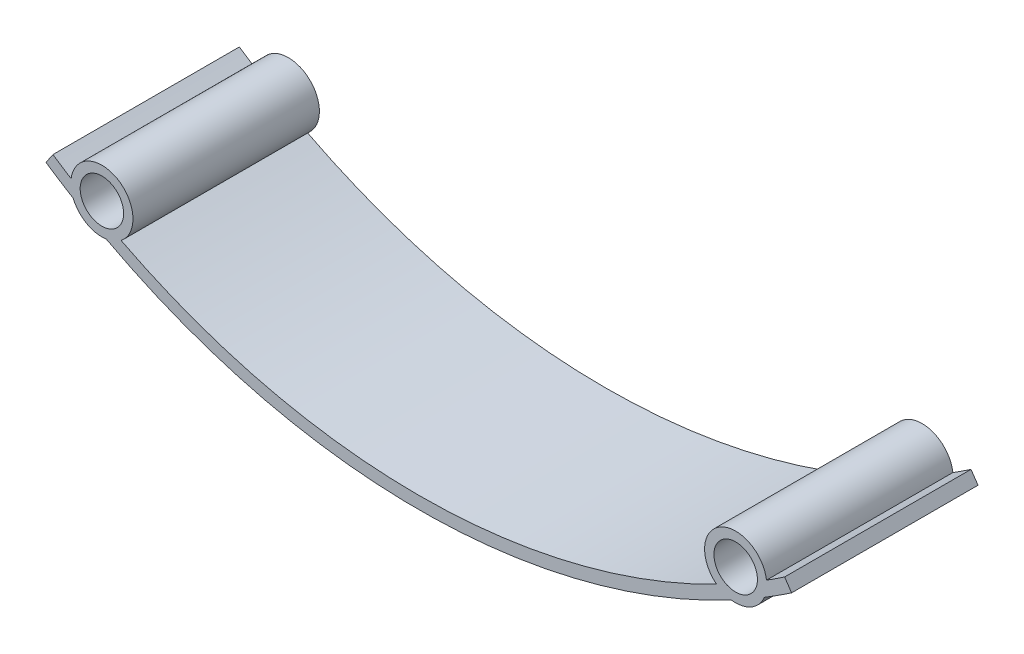
ISO-10303-21;
HEADER;
FILE_DESCRIPTION(('STEP AP214'),'2;1');
FILE_NAME('part.step','',(''),(''),'','','');
FILE_SCHEMA(('AUTOMOTIVE_DESIGN { 1 0 10303 214 1 1 1 1 }'));
ENDSEC;
DATA;
#1=APPLICATION_CONTEXT('core data for automotive mechanical design processes');
#2=APPLICATION_PROTOCOL_DEFINITION('international standard','automotive_design',2000,#1);
#3=PRODUCT_CONTEXT('',#1,'mechanical');
#4=PRODUCT('Part','Part','',(#3));
#5=PRODUCT_RELATED_PRODUCT_CATEGORY('part','',(#4));
#6=PRODUCT_DEFINITION_FORMATION('','',#4);
#7=PRODUCT_DEFINITION_CONTEXT('part definition',#1,'design');
#8=PRODUCT_DEFINITION('design','',#6,#7);
#9=PRODUCT_DEFINITION_SHAPE('','',#8);
#10=(LENGTH_UNIT() NAMED_UNIT(*) SI_UNIT(.MILLI.,.METRE.));
#11=(NAMED_UNIT(*) PLANE_ANGLE_UNIT() SI_UNIT($,.RADIAN.));
#12=(NAMED_UNIT(*) SI_UNIT($,.STERADIAN.) SOLID_ANGLE_UNIT());
#13=UNCERTAINTY_MEASURE_WITH_UNIT(LENGTH_MEASURE(1.E-05),#10,'distance_accuracy_value','');
#14=(GEOMETRIC_REPRESENTATION_CONTEXT(3) GLOBAL_UNCERTAINTY_ASSIGNED_CONTEXT((#13)) GLOBAL_UNIT_ASSIGNED_CONTEXT((#10,
#11,#12)) REPRESENTATION_CONTEXT('',''));
#15=CARTESIAN_POINT('',(0.,0.,0.));
#16=DIRECTION('',(0.,0.,1.));
#17=DIRECTION('',(1.,0.,0.));
#18=AXIS2_PLACEMENT_3D('',#15,#16,#17);
#19=CARTESIAN_POINT('',(0.,107.,30.));
#20=DIRECTION('',(0.,0.,-1.));
#21=DIRECTION('',(-1.,0.,0.));
#22=AXIS2_PLACEMENT_3D('',#19,#20,#21);
#23=PLANE('',#22);
#24=CARTESIAN_POINT('',(0.,107.,30.));
#25=DIRECTION('',(0.,0.,1.));
#26=DIRECTION('',(-1.,0.,0.));
#27=AXIS2_PLACEMENT_3D('',#24,#25,#26);
#28=CIRCLE('',#27,107.);
#29=CARTESIAN_POINT('',(55.615236982089,15.589139510526,30.));
#30=VERTEX_POINT('',#29);
#31=CARTESIAN_POINT('',(60.,18.4054177728683,30.));
#32=VERTEX_POINT('',#31);
#33=EDGE_CURVE('E181',#30,#32,#28,.T.);
#34=ORIENTED_EDGE('',*,*,#33,.T.);
#35=DIRECTION('',(-0.560747663551397,0.827986749786281,0.));
#36=VECTOR('',#35,1.);
#37=CARTESIAN_POINT('',(58.8785046728972,20.0613912724409,30.));
#38=LINE('',#37,#36);
#39=CARTESIAN_POINT('',(58.8785046728972,20.0613912724409,30.));
#40=VERTEX_POINT('',#39);
#41=EDGE_CURVE('E109',#32,#40,#38,.T.);
#42=ORIENTED_EDGE('',*,*,#41,.T.);
#43=CARTESIAN_POINT('',(0.,107.,30.));
#44=DIRECTION('',(0.,0.,-1.));
#45=DIRECTION('',(-1.,0.,0.));
#46=AXIS2_PLACEMENT_3D('',#43,#44,#45);
#47=CIRCLE('',#46,105.);
#48=CARTESIAN_POINT('',(55.9586954033888,18.1539285688402,30.));
#49=VERTEX_POINT('',#48);
#50=EDGE_CURVE('E208',#40,#49,#47,.T.);
#51=ORIENTED_EDGE('',*,*,#50,.T.);
#52=CARTESIAN_POINT('',(51.,17.5125707152116,30.));
#53=DIRECTION('',(0.,0.,1.));
#54=DIRECTION('',(1.,0.,0.));
#55=AXIS2_PLACEMENT_3D('',#52,#53,#54);
#56=CIRCLE('',#55,5.);
#57=CARTESIAN_POINT('',(47.9209350990148,13.57310890736,30.));
#58=VERTEX_POINT('',#57);
#59=EDGE_CURVE('E227',#49,#58,#56,.T.);
#60=ORIENTED_EDGE('',*,*,#59,.T.);
#61=CARTESIAN_POINT('',(0.,107.,30.));
#62=DIRECTION('',(0.,0.,-1.));
#63=DIRECTION('',(-1.,0.,0.));
#64=AXIS2_PLACEMENT_3D('',#61,#62,#63);
#65=CIRCLE('',#64,105.);
#66=CARTESIAN_POINT('',(-47.9209350990147,13.57310890736,30.));
#67=VERTEX_POINT('',#66);
#68=EDGE_CURVE('E224',#58,#67,#65,.T.);
#69=ORIENTED_EDGE('',*,*,#68,.T.);
#70=CARTESIAN_POINT('',(-51.,17.5125707152116,30.));
#71=DIRECTION('',(0.,0.,1.));
#72=DIRECTION('',(1.,0.,0.));
#73=AXIS2_PLACEMENT_3D('',#70,#71,#72);
#74=CIRCLE('',#73,5.00000000000011);
#75=CARTESIAN_POINT('',(-55.9586954033889,18.1539285688402,30.));
#76=VERTEX_POINT('',#75);
#77=EDGE_CURVE('E226',#67,#76,#74,.T.);
#78=ORIENTED_EDGE('',*,*,#77,.T.);
#79=CARTESIAN_POINT('',(0.,107.,30.));
#80=DIRECTION('',(0.,0.,-1.));
#81=DIRECTION('',(-1.,0.,0.));
#82=AXIS2_PLACEMENT_3D('',#79,#80,#81);
#83=CIRCLE('',#82,105.);
#84=CARTESIAN_POINT('',(-58.8785046728971,20.0613912724408,30.));
#85=VERTEX_POINT('',#84);
#86=EDGE_CURVE('E229',#76,#85,#83,.T.);
#87=ORIENTED_EDGE('',*,*,#86,.T.);
#88=DIRECTION('',(-0.56074766355141,-0.827986749786272,0.));
#89=VECTOR('',#88,1.);
#90=CARTESIAN_POINT('',(-60.,18.4054177728683,30.));
#91=LINE('',#90,#89);
#92=CARTESIAN_POINT('',(-60.,18.4054177728683,30.));
#93=VERTEX_POINT('',#92);
#94=EDGE_CURVE('E235',#85,#93,#91,.T.);
#95=ORIENTED_EDGE('',*,*,#94,.T.);
#96=CARTESIAN_POINT('',(0.,107.,30.));
#97=DIRECTION('',(0.,0.,1.));
#98=DIRECTION('',(-1.,0.,0.));
#99=AXIS2_PLACEMENT_3D('',#96,#97,#98);
#100=CIRCLE('',#99,107.);
#101=CARTESIAN_POINT('',(-55.615236982089,15.589139510526,30.));
#102=VERTEX_POINT('',#101);
#103=EDGE_CURVE('E140',#93,#102,#100,.T.);
#104=ORIENTED_EDGE('',*,*,#103,.T.);
#105=CARTESIAN_POINT('',(-51.,17.5125707152116,30.));
#106=DIRECTION('',(0.,0.,1.));
#107=DIRECTION('',(1.,0.,0.));
#108=AXIS2_PLACEMENT_3D('',#105,#106,#107);
#109=CIRCLE('',#108,5.00000000000005);
#110=CARTESIAN_POINT('',(-50.3026629142254,12.5614374117341,30.));
#111=VERTEX_POINT('',#110);
#112=EDGE_CURVE('E134',#102,#111,#109,.T.);
#113=ORIENTED_EDGE('',*,*,#112,.T.);
#114=CARTESIAN_POINT('',(0.,107.,30.));
#115=DIRECTION('',(0.,0.,1.));
#116=DIRECTION('',(-1.,0.,0.));
#117=AXIS2_PLACEMENT_3D('',#114,#115,#116);
#118=CIRCLE('',#117,107.);
#119=CARTESIAN_POINT('',(50.3026629142256,12.5614374117342,30.));
#120=VERTEX_POINT('',#119);
#121=EDGE_CURVE('E138',#111,#120,#118,.T.);
#122=ORIENTED_EDGE('',*,*,#121,.T.);
#123=CARTESIAN_POINT('',(51.,17.5125707152116,30.));
#124=DIRECTION('',(0.,0.,1.));
#125=DIRECTION('',(1.,0.,0.));
#126=AXIS2_PLACEMENT_3D('',#123,#124,#125);
#127=CIRCLE('',#126,5.);
#128=EDGE_CURVE('E54',#120,#30,#127,.T.);
#129=ORIENTED_EDGE('',*,*,#128,.T.);
#130=EDGE_LOOP('',(#34,#42,#51,#60,#69,#78,#87,#95,#104,#113,#122,#129));
#131=FACE_BOUND('',#130,.T.);
#132=CARTESIAN_POINT('',(-51.,17.5125707152116,30.));
#133=DIRECTION('',(0.,0.,1.));
#134=DIRECTION('',(1.,0.,0.));
#135=AXIS2_PLACEMENT_3D('',#132,#133,#134);
#136=CIRCLE('',#135,3.5);
#137=CARTESIAN_POINT('',(-47.5,17.5125707152116,30.));
#138=VERTEX_POINT('',#137);
#139=EDGE_CURVE('E162',#138,#138,#136,.T.);
#140=ORIENTED_EDGE('',*,*,#139,.F.);
#141=EDGE_LOOP('',(#140));
#142=FACE_BOUND('',#141,.T.);
#143=CARTESIAN_POINT('',(51.,17.5125707152116,30.));
#144=DIRECTION('',(0.,0.,1.));
#145=DIRECTION('',(1.,0.,0.));
#146=AXIS2_PLACEMENT_3D('',#143,#144,#145);
#147=CIRCLE('',#146,3.5);
#148=CARTESIAN_POINT('',(54.5,17.5125707152116,30.));
#149=VERTEX_POINT('',#148);
#150=EDGE_CURVE('E276',#149,#149,#147,.T.);
#151=ORIENTED_EDGE('',*,*,#150,.F.);
#152=EDGE_LOOP('',(#151));
#153=FACE_BOUND('',#152,.T.);
#154=ADVANCED_FACE('F37',(#131,#142,#153),#23,.F.);
#155=CARTESIAN_POINT('',(0.,107.,0.));
#156=DIRECTION('',(0.,0.,-1.));
#157=DIRECTION('',(-1.,0.,0.));
#158=AXIS2_PLACEMENT_3D('',#155,#156,#157);
#159=PLANE('',#158);
#160=CARTESIAN_POINT('',(-51.,17.5125707152116,0.));
#161=DIRECTION('',(0.,0.,1.));
#162=DIRECTION('',(1.,0.,0.));
#163=AXIS2_PLACEMENT_3D('',#160,#161,#162);
#164=CIRCLE('',#163,3.5);
#165=CARTESIAN_POINT('',(-47.5,17.5125707152116,0.));
#166=VERTEX_POINT('',#165);
#167=EDGE_CURVE('E281',#166,#166,#164,.T.);
#168=ORIENTED_EDGE('',*,*,#167,.T.);
#169=EDGE_LOOP('',(#168));
#170=FACE_BOUND('',#169,.T.);
#171=CARTESIAN_POINT('',(0.,107.,0.));
#172=DIRECTION('',(0.,0.,1.));
#173=DIRECTION('',(-1.,0.,0.));
#174=AXIS2_PLACEMENT_3D('',#171,#172,#173);
#175=CIRCLE('',#174,107.);
#176=CARTESIAN_POINT('',(55.615236982089,15.589139510526,0.));
#177=VERTEX_POINT('',#176);
#178=CARTESIAN_POINT('',(60.,18.4054177728683,0.));
#179=VERTEX_POINT('',#178);
#180=EDGE_CURVE('E158',#177,#179,#175,.T.);
#181=ORIENTED_EDGE('',*,*,#180,.F.);
#182=CARTESIAN_POINT('',(51.,17.5125707152116,0.));
#183=DIRECTION('',(0.,0.,1.));
#184=DIRECTION('',(1.,0.,0.));
#185=AXIS2_PLACEMENT_3D('',#182,#183,#184);
#186=CIRCLE('',#185,5.);
#187=CARTESIAN_POINT('',(50.3026629142256,12.5614374117342,0.));
#188=VERTEX_POINT('',#187);
#189=EDGE_CURVE('E101',#188,#177,#186,.T.);
#190=ORIENTED_EDGE('',*,*,#189,.F.);
#191=CARTESIAN_POINT('',(0.,107.,0.));
#192=DIRECTION('',(0.,0.,1.));
#193=DIRECTION('',(-1.,0.,0.));
#194=AXIS2_PLACEMENT_3D('',#191,#192,#193);
#195=CIRCLE('',#194,107.);
#196=CARTESIAN_POINT('',(-50.3026629142254,12.5614374117341,0.));
#197=VERTEX_POINT('',#196);
#198=EDGE_CURVE('E95',#197,#188,#195,.T.);
#199=ORIENTED_EDGE('',*,*,#198,.F.);
#200=CARTESIAN_POINT('',(-51.,17.5125707152116,0.));
#201=DIRECTION('',(0.,0.,1.));
#202=DIRECTION('',(1.,0.,0.));
#203=AXIS2_PLACEMENT_3D('',#200,#201,#202);
#204=CIRCLE('',#203,5.00000000000005);
#205=CARTESIAN_POINT('',(-55.615236982089,15.589139510526,0.));
#206=VERTEX_POINT('',#205);
#207=EDGE_CURVE('E148',#206,#197,#204,.T.);
#208=ORIENTED_EDGE('',*,*,#207,.F.);
#209=CARTESIAN_POINT('',(0.,107.,0.));
#210=DIRECTION('',(0.,0.,1.));
#211=DIRECTION('',(-1.,0.,0.));
#212=AXIS2_PLACEMENT_3D('',#209,#210,#211);
#213=CIRCLE('',#212,107.);
#214=CARTESIAN_POINT('',(-60.,18.4054177728683,0.));
#215=VERTEX_POINT('',#214);
#216=EDGE_CURVE('E176',#215,#206,#213,.T.);
#217=ORIENTED_EDGE('',*,*,#216,.F.);
#218=DIRECTION('',(-0.56074766355141,-0.827986749786272,0.));
#219=VECTOR('',#218,1.);
#220=CARTESIAN_POINT('',(-60.,18.4054177728683,0.));
#221=LINE('',#220,#219);
#222=CARTESIAN_POINT('',(-58.8785046728971,20.0613912724408,0.));
#223=VERTEX_POINT('',#222);
#224=EDGE_CURVE('E174',#223,#215,#221,.T.);
#225=ORIENTED_EDGE('',*,*,#224,.F.);
#226=CARTESIAN_POINT('',(0.,107.,0.));
#227=DIRECTION('',(0.,0.,-1.));
#228=DIRECTION('',(-1.,0.,0.));
#229=AXIS2_PLACEMENT_3D('',#226,#227,#228);
#230=CIRCLE('',#229,105.);
#231=CARTESIAN_POINT('',(-55.9586954033889,18.1539285688402,0.));
#232=VERTEX_POINT('',#231);
#233=EDGE_CURVE('E172',#232,#223,#230,.T.);
#234=ORIENTED_EDGE('',*,*,#233,.F.);
#235=CARTESIAN_POINT('',(-51.,17.5125707152116,0.));
#236=DIRECTION('',(0.,0.,1.));
#237=DIRECTION('',(1.,0.,0.));
#238=AXIS2_PLACEMENT_3D('',#235,#236,#237);
#239=CIRCLE('',#238,5.00000000000011);
#240=CARTESIAN_POINT('',(-47.9209350990147,13.57310890736,0.));
#241=VERTEX_POINT('',#240);
#242=EDGE_CURVE('E170',#241,#232,#239,.T.);
#243=ORIENTED_EDGE('',*,*,#242,.F.);
#244=CARTESIAN_POINT('',(0.,107.,0.));
#245=DIRECTION('',(0.,0.,-1.));
#246=DIRECTION('',(-1.,0.,0.));
#247=AXIS2_PLACEMENT_3D('',#244,#245,#246);
#248=CIRCLE('',#247,105.);
#249=CARTESIAN_POINT('',(47.9209350990148,13.57310890736,0.));
#250=VERTEX_POINT('',#249);
#251=EDGE_CURVE('E168',#250,#241,#248,.T.);
#252=ORIENTED_EDGE('',*,*,#251,.F.);
#253=CARTESIAN_POINT('',(51.,17.5125707152116,0.));
#254=DIRECTION('',(0.,0.,1.));
#255=DIRECTION('',(1.,0.,0.));
#256=AXIS2_PLACEMENT_3D('',#253,#254,#255);
#257=CIRCLE('',#256,5.);
#258=CARTESIAN_POINT('',(55.9586954033888,18.1539285688402,0.));
#259=VERTEX_POINT('',#258);
#260=EDGE_CURVE('E166',#259,#250,#257,.T.);
#261=ORIENTED_EDGE('',*,*,#260,.F.);
#262=CARTESIAN_POINT('',(0.,107.,0.));
#263=DIRECTION('',(0.,0.,-1.));
#264=DIRECTION('',(-1.,0.,0.));
#265=AXIS2_PLACEMENT_3D('',#262,#263,#264);
#266=CIRCLE('',#265,105.);
#267=CARTESIAN_POINT('',(58.8785046728972,20.0613912724409,0.));
#268=VERTEX_POINT('',#267);
#269=EDGE_CURVE('E164',#268,#259,#266,.T.);
#270=ORIENTED_EDGE('',*,*,#269,.F.);
#271=DIRECTION('',(-0.560747663551397,0.827986749786281,0.));
#272=VECTOR('',#271,1.);
#273=CARTESIAN_POINT('',(58.8785046728972,20.0613912724409,0.));
#274=LINE('',#273,#272);
#275=EDGE_CURVE('E161',#179,#268,#274,.T.);
#276=ORIENTED_EDGE('',*,*,#275,.F.);
#277=EDGE_LOOP('',(#181,#190,#199,#208,#217,#225,#234,#243,#252,#261,#270,#276));
#278=FACE_BOUND('',#277,.T.);
#279=CARTESIAN_POINT('',(51.,17.5125707152116,0.));
#280=DIRECTION('',(0.,0.,1.));
#281=DIRECTION('',(1.,0.,0.));
#282=AXIS2_PLACEMENT_3D('',#279,#280,#281);
#283=CIRCLE('',#282,3.5);
#284=CARTESIAN_POINT('',(54.5,17.5125707152116,0.));
#285=VERTEX_POINT('',#284);
#286=EDGE_CURVE('E279',#285,#285,#283,.T.);
#287=ORIENTED_EDGE('',*,*,#286,.T.);
#288=EDGE_LOOP('',(#287));
#289=FACE_BOUND('',#288,.T.);
#290=ADVANCED_FACE('F212',(#170,#278,#289),#159,.T.);
#291=CARTESIAN_POINT('',(0.,107.,30.));
#292=DIRECTION('',(0.,0.,-1.));
#293=DIRECTION('',(-1.,0.,0.));
#294=AXIS2_PLACEMENT_3D('',#291,#292,#293);
#295=CYLINDRICAL_SURFACE('',#294,107.);
#296=ORIENTED_EDGE('',*,*,#180,.T.);
#297=DIRECTION('',(0.,0.,-1.));
#298=VECTOR('',#297,1.);
#299=CARTESIAN_POINT('',(60.,18.4054177728683,30.));
#300=LINE('',#299,#298);
#301=EDGE_CURVE('E11',#32,#179,#300,.T.);
#302=ORIENTED_EDGE('',*,*,#301,.F.);
#303=ORIENTED_EDGE('',*,*,#33,.F.);
#304=DIRECTION('',(0.,0.,-1.));
#305=VECTOR('',#304,1.);
#306=CARTESIAN_POINT('',(55.615236982089,15.589139510526,30.));
#307=LINE('',#306,#305);
#308=EDGE_CURVE('E154',#30,#177,#307,.T.);
#309=ORIENTED_EDGE('',*,*,#308,.T.);
#310=EDGE_LOOP('',(#296,#302,#303,#309));
#311=FACE_BOUND('',#310,.T.);
#312=ADVANCED_FACE('F39',(#311),#295,.T.);
#313=CARTESIAN_POINT('',(58.8785046728972,20.0613912724409,30.));
#314=DIRECTION('',(-0.827986749786281,-0.560747663551397,0.));
#315=DIRECTION('',(0.560747663551397,-0.827986749786281,0.));
#316=AXIS2_PLACEMENT_3D('',#313,#314,#315);
#317=PLANE('',#316);
#318=ORIENTED_EDGE('',*,*,#275,.T.);
#319=DIRECTION('',(0.,0.,-1.));
#320=VECTOR('',#319,1.);
#321=CARTESIAN_POINT('',(58.8785046728972,20.0613912724409,30.));
#322=LINE('',#321,#320);
#323=EDGE_CURVE('E46',#40,#268,#322,.T.);
#324=ORIENTED_EDGE('',*,*,#323,.F.);
#325=ORIENTED_EDGE('',*,*,#41,.F.);
#326=ORIENTED_EDGE('',*,*,#301,.T.);
#327=EDGE_LOOP('',(#318,#324,#325,#326));
#328=FACE_BOUND('',#327,.T.);
#329=ADVANCED_FACE('F386',(#328),#317,.F.);
#330=CARTESIAN_POINT('',(0.,107.,30.));
#331=DIRECTION('',(0.,0.,-1.));
#332=DIRECTION('',(-1.,0.,0.));
#333=AXIS2_PLACEMENT_3D('',#330,#331,#332);
#334=CYLINDRICAL_SURFACE('',#333,105.);
#335=ORIENTED_EDGE('',*,*,#269,.T.);
#336=DIRECTION('',(0.,0.,-1.));
#337=VECTOR('',#336,1.);
#338=CARTESIAN_POINT('',(55.9586954033888,18.1539285688402,30.));
#339=LINE('',#338,#337);
#340=EDGE_CURVE('E200',#49,#259,#339,.T.);
#341=ORIENTED_EDGE('',*,*,#340,.F.);
#342=ORIENTED_EDGE('',*,*,#50,.F.);
#343=ORIENTED_EDGE('',*,*,#323,.T.);
#344=EDGE_LOOP('',(#335,#341,#342,#343));
#345=FACE_BOUND('',#344,.T.);
#346=ADVANCED_FACE('F206',(#345),#334,.F.);
#347=CARTESIAN_POINT('',(51.,17.5125707152116,30.));
#348=DIRECTION('',(0.,0.,-1.));
#349=DIRECTION('',(-1.,0.,0.));
#350=AXIS2_PLACEMENT_3D('',#347,#348,#349);
#351=CYLINDRICAL_SURFACE('',#350,5.);
#352=ORIENTED_EDGE('',*,*,#260,.T.);
#353=DIRECTION('',(0.,0.,-1.));
#354=VECTOR('',#353,1.);
#355=CARTESIAN_POINT('',(47.9209350990148,13.57310890736,30.));
#356=LINE('',#355,#354);
#357=EDGE_CURVE('E197',#58,#250,#356,.T.);
#358=ORIENTED_EDGE('',*,*,#357,.F.);
#359=ORIENTED_EDGE('',*,*,#59,.F.);
#360=ORIENTED_EDGE('',*,*,#340,.T.);
#361=EDGE_LOOP('',(#352,#358,#359,#360));
#362=FACE_BOUND('',#361,.T.);
#363=ADVANCED_FACE('F218',(#362),#351,.T.);
#364=CARTESIAN_POINT('',(0.,107.,30.));
#365=DIRECTION('',(0.,0.,-1.));
#366=DIRECTION('',(-1.,0.,0.));
#367=AXIS2_PLACEMENT_3D('',#364,#365,#366);
#368=CYLINDRICAL_SURFACE('',#367,105.);
#369=ORIENTED_EDGE('',*,*,#251,.T.);
#370=DIRECTION('',(0.,0.,-1.));
#371=VECTOR('',#370,1.);
#372=CARTESIAN_POINT('',(-47.9209350990147,13.57310890736,30.));
#373=LINE('',#372,#371);
#374=EDGE_CURVE('E194',#67,#241,#373,.T.);
#375=ORIENTED_EDGE('',*,*,#374,.F.);
#376=ORIENTED_EDGE('',*,*,#68,.F.);
#377=ORIENTED_EDGE('',*,*,#357,.T.);
#378=EDGE_LOOP('',(#369,#375,#376,#377));
#379=FACE_BOUND('',#378,.T.);
#380=ADVANCED_FACE('F222',(#379),#368,.F.);
#381=CARTESIAN_POINT('',(-51.,17.5125707152116,30.));
#382=DIRECTION('',(0.,0.,-1.));
#383=DIRECTION('',(-1.,0.,0.));
#384=AXIS2_PLACEMENT_3D('',#381,#382,#383);
#385=CYLINDRICAL_SURFACE('',#384,5.00000000000011);
#386=ORIENTED_EDGE('',*,*,#242,.T.);
#387=DIRECTION('',(0.,0.,-1.));
#388=VECTOR('',#387,1.);
#389=CARTESIAN_POINT('',(-55.9586954033889,18.1539285688402,30.));
#390=LINE('',#389,#388);
#391=EDGE_CURVE('E191',#76,#232,#390,.T.);
#392=ORIENTED_EDGE('',*,*,#391,.F.);
#393=ORIENTED_EDGE('',*,*,#77,.F.);
#394=ORIENTED_EDGE('',*,*,#374,.T.);
#395=EDGE_LOOP('',(#386,#392,#393,#394));
#396=FACE_BOUND('',#395,.T.);
#397=ADVANCED_FACE('F347',(#396),#385,.T.);
#398=CARTESIAN_POINT('',(0.,107.,30.));
#399=DIRECTION('',(0.,0.,-1.));
#400=DIRECTION('',(-1.,0.,0.));
#401=AXIS2_PLACEMENT_3D('',#398,#399,#400);
#402=CYLINDRICAL_SURFACE('',#401,105.);
#403=ORIENTED_EDGE('',*,*,#233,.T.);
#404=DIRECTION('',(0.,0.,-1.));
#405=VECTOR('',#404,1.);
#406=CARTESIAN_POINT('',(-58.8785046728971,20.0613912724408,30.));
#407=LINE('',#406,#405);
#408=EDGE_CURVE('E188',#85,#223,#407,.T.);
#409=ORIENTED_EDGE('',*,*,#408,.F.);
#410=ORIENTED_EDGE('',*,*,#86,.F.);
#411=ORIENTED_EDGE('',*,*,#391,.T.);
#412=EDGE_LOOP('',(#403,#409,#410,#411));
#413=FACE_BOUND('',#412,.T.);
#414=ADVANCED_FACE('F337',(#413),#402,.F.);
#415=CARTESIAN_POINT('',(-60.,18.4054177728683,30.));
#416=DIRECTION('',(0.827986749786272,-0.56074766355141,0.));
#417=DIRECTION('',(0.56074766355141,0.827986749786272,0.));
#418=AXIS2_PLACEMENT_3D('',#415,#416,#417);
#419=PLANE('',#418);
#420=ORIENTED_EDGE('',*,*,#224,.T.);
#421=DIRECTION('',(0.,0.,-1.));
#422=VECTOR('',#421,1.);
#423=CARTESIAN_POINT('',(-60.,18.4054177728683,30.));
#424=LINE('',#423,#422);
#425=EDGE_CURVE('E185',#93,#215,#424,.T.);
#426=ORIENTED_EDGE('',*,*,#425,.F.);
#427=ORIENTED_EDGE('',*,*,#94,.F.);
#428=ORIENTED_EDGE('',*,*,#408,.T.);
#429=EDGE_LOOP('',(#420,#426,#427,#428));
#430=FACE_BOUND('',#429,.T.);
#431=ADVANCED_FACE('F241',(#430),#419,.F.);
#432=CARTESIAN_POINT('',(0.,107.,30.));
#433=DIRECTION('',(0.,0.,-1.));
#434=DIRECTION('',(-1.,0.,0.));
#435=AXIS2_PLACEMENT_3D('',#432,#433,#434);
#436=CYLINDRICAL_SURFACE('',#435,107.);
#437=ORIENTED_EDGE('',*,*,#216,.T.);
#438=DIRECTION('',(0.,0.,-1.));
#439=VECTOR('',#438,1.);
#440=CARTESIAN_POINT('',(-55.615236982089,15.589139510526,30.));
#441=LINE('',#440,#439);
#442=EDGE_CURVE('E149',#102,#206,#441,.T.);
#443=ORIENTED_EDGE('',*,*,#442,.F.);
#444=ORIENTED_EDGE('',*,*,#103,.F.);
#445=ORIENTED_EDGE('',*,*,#425,.T.);
#446=EDGE_LOOP('',(#437,#443,#444,#445));
#447=FACE_BOUND('',#446,.T.);
#448=ADVANCED_FACE('F245',(#447),#436,.T.);
#449=CARTESIAN_POINT('',(-51.,17.5125707152116,30.));
#450=DIRECTION('',(0.,0.,-1.));
#451=DIRECTION('',(-1.,0.,0.));
#452=AXIS2_PLACEMENT_3D('',#449,#450,#451);
#453=CYLINDRICAL_SURFACE('',#452,5.00000000000005);
#454=ORIENTED_EDGE('',*,*,#207,.T.);
#455=DIRECTION('',(0.,0.,-1.));
#456=VECTOR('',#455,1.);
#457=CARTESIAN_POINT('',(-50.3026629142254,12.5614374117341,30.));
#458=LINE('',#457,#456);
#459=EDGE_CURVE('E145',#111,#197,#458,.T.);
#460=ORIENTED_EDGE('',*,*,#459,.F.);
#461=ORIENTED_EDGE('',*,*,#112,.F.);
#462=ORIENTED_EDGE('',*,*,#442,.T.);
#463=EDGE_LOOP('',(#454,#460,#461,#462));
#464=FACE_BOUND('',#463,.T.);
#465=ADVANCED_FACE('F146',(#464),#453,.T.);
#466=CARTESIAN_POINT('',(0.,107.,30.));
#467=DIRECTION('',(0.,0.,-1.));
#468=DIRECTION('',(-1.,0.,0.));
#469=AXIS2_PLACEMENT_3D('',#466,#467,#468);
#470=CYLINDRICAL_SURFACE('',#469,107.);
#471=ORIENTED_EDGE('',*,*,#198,.T.);
#472=DIRECTION('',(0.,0.,-1.));
#473=VECTOR('',#472,1.);
#474=CARTESIAN_POINT('',(50.3026629142256,12.5614374117342,30.));
#475=LINE('',#474,#473);
#476=EDGE_CURVE('E150',#120,#188,#475,.T.);
#477=ORIENTED_EDGE('',*,*,#476,.F.);
#478=ORIENTED_EDGE('',*,*,#121,.F.);
#479=ORIENTED_EDGE('',*,*,#459,.T.);
#480=EDGE_LOOP('',(#471,#477,#478,#479));
#481=FACE_BOUND('',#480,.T.);
#482=ADVANCED_FACE('F152',(#481),#470,.T.);
#483=CARTESIAN_POINT('',(51.,17.5125707152116,30.));
#484=DIRECTION('',(0.,0.,-1.));
#485=DIRECTION('',(-1.,0.,0.));
#486=AXIS2_PLACEMENT_3D('',#483,#484,#485);
#487=CYLINDRICAL_SURFACE('',#486,5.);
#488=ORIENTED_EDGE('',*,*,#189,.T.);
#489=ORIENTED_EDGE('',*,*,#308,.F.);
#490=ORIENTED_EDGE('',*,*,#128,.F.);
#491=ORIENTED_EDGE('',*,*,#476,.T.);
#492=EDGE_LOOP('',(#488,#489,#490,#491));
#493=FACE_BOUND('',#492,.T.);
#494=ADVANCED_FACE('F249',(#493),#487,.T.);
#495=CARTESIAN_POINT('',(-51.,17.5125707152116,30.));
#496=DIRECTION('',(0.,0.,-1.));
#497=DIRECTION('',(-1.,0.,0.));
#498=AXIS2_PLACEMENT_3D('',#495,#496,#497);
#499=CYLINDRICAL_SURFACE('',#498,3.5);
#500=ORIENTED_EDGE('',*,*,#139,.T.);
#501=EDGE_LOOP('',(#500));
#502=FACE_BOUND('',#501,.T.);
#503=ORIENTED_EDGE('',*,*,#167,.F.);
#504=EDGE_LOOP('',(#503));
#505=FACE_BOUND('',#504,.T.);
#506=ADVANCED_FACE('F251',(#502,#505),#499,.F.);
#507=CARTESIAN_POINT('',(51.,17.5125707152116,30.));
#508=DIRECTION('',(0.,0.,-1.));
#509=DIRECTION('',(-1.,0.,0.));
#510=AXIS2_PLACEMENT_3D('',#507,#508,#509);
#511=CYLINDRICAL_SURFACE('',#510,3.5);
#512=ORIENTED_EDGE('',*,*,#150,.T.);
#513=EDGE_LOOP('',(#512));
#514=FACE_BOUND('',#513,.T.);
#515=ORIENTED_EDGE('',*,*,#286,.F.);
#516=EDGE_LOOP('',(#515));
#517=FACE_BOUND('',#516,.T.);
#518=ADVANCED_FACE('F257',(#514,#517),#511,.F.);
#519=CLOSED_SHELL('',(#154,#290,#312,#329,#346,#363,#380,#397,#414,#431,#448,#465,#482,#494,
#506,#518));
#520=MANIFOLD_SOLID_BREP('B2',#519);
#521=ADVANCED_BREP_SHAPE_REPRESENTATION('',(#18,#520),#14);
#522=SHAPE_DEFINITION_REPRESENTATION(#9,#521);
ENDSEC;
END-ISO-10303-21;
